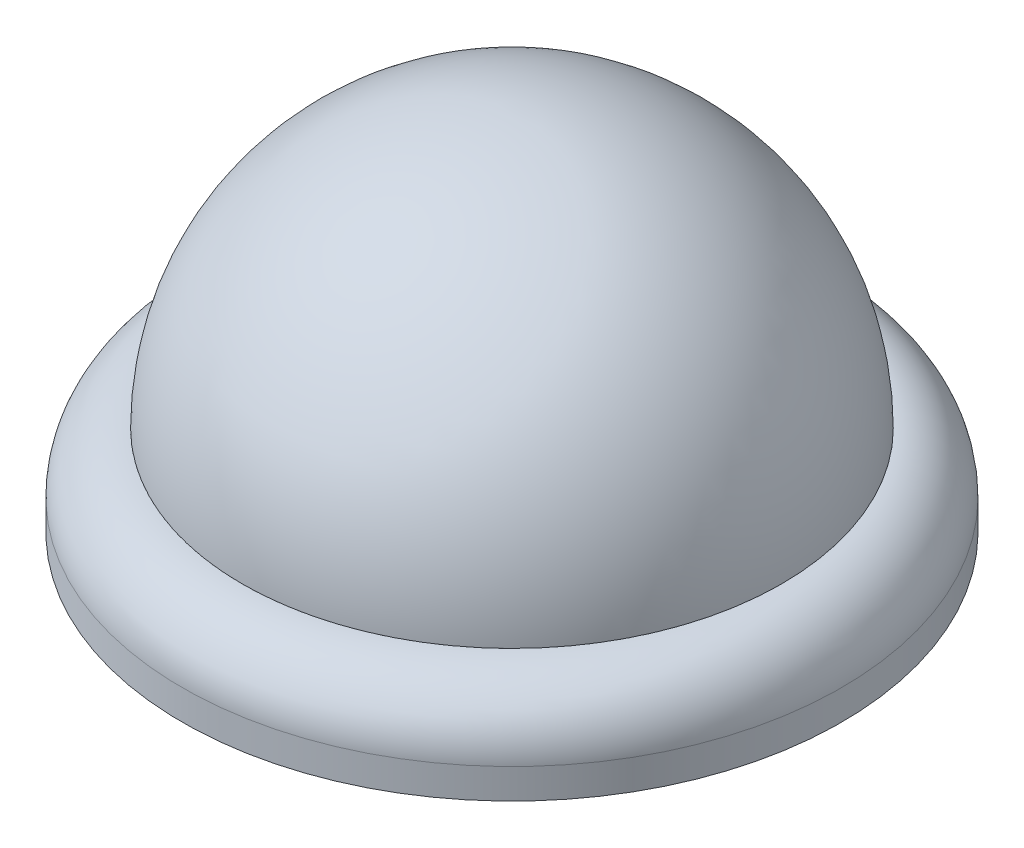
ISO-10303-21;
HEADER;
FILE_DESCRIPTION(('STEP AP214'),'2;1');
FILE_NAME('part.step','',(''),(''),'','','');
FILE_SCHEMA(('AUTOMOTIVE_DESIGN { 1 0 10303 214 1 1 1 1 }'));
ENDSEC;
DATA;
#1=APPLICATION_CONTEXT('core data for automotive mechanical design processes');
#2=APPLICATION_PROTOCOL_DEFINITION('international standard','automotive_design',2000,#1);
#3=PRODUCT_CONTEXT('',#1,'mechanical');
#4=PRODUCT('Part','Part','',(#3));
#5=PRODUCT_RELATED_PRODUCT_CATEGORY('part','',(#4));
#6=PRODUCT_DEFINITION_FORMATION('','',#4);
#7=PRODUCT_DEFINITION_CONTEXT('part definition',#1,'design');
#8=PRODUCT_DEFINITION('design','',#6,#7);
#9=PRODUCT_DEFINITION_SHAPE('','',#8);
#10=(LENGTH_UNIT() NAMED_UNIT(*) SI_UNIT(.MILLI.,.METRE.));
#11=(NAMED_UNIT(*) PLANE_ANGLE_UNIT() SI_UNIT($,.RADIAN.));
#12=(NAMED_UNIT(*) SI_UNIT($,.STERADIAN.) SOLID_ANGLE_UNIT());
#13=UNCERTAINTY_MEASURE_WITH_UNIT(LENGTH_MEASURE(1.E-05),#10,'distance_accuracy_value','');
#14=(GEOMETRIC_REPRESENTATION_CONTEXT(3) GLOBAL_UNCERTAINTY_ASSIGNED_CONTEXT((#13)) GLOBAL_UNIT_ASSIGNED_CONTEXT((#10,
#11,#12)) REPRESENTATION_CONTEXT('',''));
#15=CARTESIAN_POINT('',(0.,0.,0.));
#16=DIRECTION('',(0.,0.,1.));
#17=DIRECTION('',(1.,0.,0.));
#18=AXIS2_PLACEMENT_3D('',#15,#16,#17);
#19=CARTESIAN_POINT('',(0.,-12.5,0.));
#20=DIRECTION('',(0.,-1.,0.));
#21=DIRECTION('',(0.,0.,-1.));
#22=AXIS2_PLACEMENT_3D('',#19,#20,#21);
#23=CYLINDRICAL_SURFACE('',#22,50.);
#24=CARTESIAN_POINT('',(0.,-12.5,0.));
#25=DIRECTION('',(0.,-1.,0.));
#26=DIRECTION('',(0.,0.,-1.));
#27=AXIS2_PLACEMENT_3D('',#24,#25,#26);
#28=CIRCLE('',#27,50.);
#29=CARTESIAN_POINT('',(0.,-12.5,-50.));
#30=VERTEX_POINT('',#29);
#31=EDGE_CURVE('E11',#30,#30,#28,.T.);
#32=ORIENTED_EDGE('',*,*,#31,.T.);
#33=EDGE_LOOP('',(#32));
#34=FACE_BOUND('',#33,.T.);
#35=CARTESIAN_POINT('',(0.,-15.,0.));
#36=DIRECTION('',(0.,-1.,0.));
#37=DIRECTION('',(0.,0.,-1.));
#38=AXIS2_PLACEMENT_3D('',#35,#36,#37);
#39=CIRCLE('',#38,50.);
#40=CARTESIAN_POINT('',(0.,-15.,-50.));
#41=VERTEX_POINT('',#40);
#42=EDGE_CURVE('E45',#41,#41,#39,.T.);
#43=ORIENTED_EDGE('',*,*,#42,.F.);
#44=EDGE_LOOP('',(#43));
#45=FACE_BOUND('',#44,.T.);
#46=ADVANCED_FACE('F42',(#34,#45),#23,.T.);
#47=CARTESIAN_POINT('',(0.,-12.5,0.));
#48=DIRECTION('',(0.,-1.,0.));
#49=DIRECTION('',(0.,0.,-1.));
#50=AXIS2_PLACEMENT_3D('',#47,#48,#49);
#51=PLANE('',#50);
#52=ORIENTED_EDGE('',*,*,#31,.F.);
#53=EDGE_LOOP('',(#52));
#54=FACE_BOUND('',#53,.T.);
#55=ADVANCED_FACE('F57',(#54),#51,.F.);
#56=CARTESIAN_POINT('',(0.,-15.,0.));
#57=DIRECTION('',(0.,-1.,0.));
#58=DIRECTION('',(0.,0.,-1.));
#59=AXIS2_PLACEMENT_3D('',#56,#57,#58);
#60=PLANE('',#59);
#61=ORIENTED_EDGE('',*,*,#42,.T.);
#62=EDGE_LOOP('',(#61));
#63=FACE_BOUND('',#62,.T.);
#64=ADVANCED_FACE('F54',(#63),#60,.T.);
#65=CLOSED_SHELL('',(#46,#55,#64));
#66=MANIFOLD_SOLID_BREP('B2',#65);
#67=CARTESIAN_POINT('',(0.,0.,0.));
#68=DIRECTION('',(0.,-1.,0.));
#69=DIRECTION('',(0.,0.,-1.));
#70=AXIS2_PLACEMENT_3D('',#67,#68,#69);
#71=CYLINDRICAL_SURFACE('',#70,50.);
#72=CARTESIAN_POINT('',(0.,-5.,0.));
#73=DIRECTION('',(0.,-1.,0.));
#74=DIRECTION('',(0.,0.,-1.));
#75=AXIS2_PLACEMENT_3D('',#72,#73,#74);
#76=CIRCLE('',#75,50.);
#77=CARTESIAN_POINT('',(0.,-5.,-50.));
#78=VERTEX_POINT('',#77);
#79=EDGE_CURVE('E113',#78,#78,#76,.T.);
#80=ORIENTED_EDGE('',*,*,#79,.F.);
#81=EDGE_LOOP('',(#80));
#82=FACE_BOUND('',#81,.T.);
#83=CARTESIAN_POINT('',(0.,-15.,0.));
#84=DIRECTION('',(0.,-1.,0.));
#85=DIRECTION('',(0.,0.,-1.));
#86=AXIS2_PLACEMENT_3D('',#83,#84,#85);
#87=CIRCLE('',#86,50.);
#88=CARTESIAN_POINT('',(0.,-15.,-50.));
#89=VERTEX_POINT('',#88);
#90=EDGE_CURVE('E97',#89,#89,#87,.T.);
#91=ORIENTED_EDGE('',*,*,#90,.T.);
#92=EDGE_LOOP('',(#91));
#93=FACE_BOUND('',#92,.T.);
#94=ADVANCED_FACE('F90',(#82,#93),#71,.F.);
#95=CARTESIAN_POINT('',(-55.,-15.,0.));
#96=DIRECTION('',(0.,1.,0.));
#97=DIRECTION('',(0.,0.,1.));
#98=AXIS2_PLACEMENT_3D('',#95,#96,#97);
#99=PLANE('',#98);
#100=ORIENTED_EDGE('',*,*,#90,.F.);
#101=EDGE_LOOP('',(#100));
#102=FACE_BOUND('',#101,.T.);
#103=CARTESIAN_POINT('',(0.,-15.,0.));
#104=DIRECTION('',(0.,-1.,0.));
#105=DIRECTION('',(0.,0.,-1.));
#106=AXIS2_PLACEMENT_3D('',#103,#104,#105);
#107=CIRCLE('',#106,55.);
#108=CARTESIAN_POINT('',(0.,-15.,-55.));
#109=VERTEX_POINT('',#108);
#110=EDGE_CURVE('E101',#109,#109,#107,.T.);
#111=ORIENTED_EDGE('',*,*,#110,.T.);
#112=EDGE_LOOP('',(#111));
#113=FACE_BOUND('',#112,.T.);
#114=ADVANCED_FACE('F120',(#102,#113),#99,.F.);
#115=CARTESIAN_POINT('',(0.,0.,0.));
#116=DIRECTION('',(0.,-1.,0.));
#117=DIRECTION('',(0.,0.,-1.));
#118=AXIS2_PLACEMENT_3D('',#115,#116,#117);
#119=CYLINDRICAL_SURFACE('',#118,55.);
#120=CARTESIAN_POINT('',(0.,-10.,0.));
#121=DIRECTION('',(0.,-1.,0.));
#122=DIRECTION('',(0.,0.,-1.));
#123=AXIS2_PLACEMENT_3D('',#120,#121,#122);
#124=CIRCLE('',#123,55.);
#125=CARTESIAN_POINT('',(0.,-10.,-55.));
#126=VERTEX_POINT('',#125);
#127=EDGE_CURVE('E41',#126,#126,#124,.T.);
#128=ORIENTED_EDGE('',*,*,#127,.T.);
#129=EDGE_LOOP('',(#128));
#130=FACE_BOUND('',#129,.T.);
#131=ORIENTED_EDGE('',*,*,#110,.F.);
#132=EDGE_LOOP('',(#131));
#133=FACE_BOUND('',#132,.T.);
#134=ADVANCED_FACE('F124',(#130,#133),#119,.T.);
#135=CARTESIAN_POINT('',(0.,0.,0.));
#136=DIRECTION('',(0.,-1.,0.));
#137=DIRECTION('',(0.,0.,-1.));
#138=AXIS2_PLACEMENT_3D('',#135,#136,#137);
#139=CYLINDRICAL_SURFACE('',#138,45.);
#140=CARTESIAN_POINT('',(0.,0.,0.));
#141=DIRECTION('',(0.,-1.,0.));
#142=DIRECTION('',(0.,0.,-1.));
#143=AXIS2_PLACEMENT_3D('',#140,#141,#142);
#144=CIRCLE('',#143,45.);
#145=CARTESIAN_POINT('',(0.,0.,-45.));
#146=VERTEX_POINT('',#145);
#147=EDGE_CURVE('E105',#146,#146,#144,.T.);
#148=ORIENTED_EDGE('',*,*,#147,.F.);
#149=EDGE_LOOP('',(#148));
#150=FACE_BOUND('',#149,.T.);
#151=CARTESIAN_POINT('',(0.,-5.,0.));
#152=DIRECTION('',(0.,-1.,0.));
#153=DIRECTION('',(0.,0.,-1.));
#154=AXIS2_PLACEMENT_3D('',#151,#152,#153);
#155=CIRCLE('',#154,45.);
#156=CARTESIAN_POINT('',(0.,-5.,-45.));
#157=VERTEX_POINT('',#156);
#158=EDGE_CURVE('E110',#157,#157,#155,.T.);
#159=ORIENTED_EDGE('',*,*,#158,.T.);
#160=EDGE_LOOP('',(#159));
#161=FACE_BOUND('',#160,.T.);
#162=ADVANCED_FACE('F130',(#150,#161),#139,.F.);
#163=CARTESIAN_POINT('',(-50.,-5.,0.));
#164=DIRECTION('',(0.,1.,0.));
#165=DIRECTION('',(0.,0.,1.));
#166=AXIS2_PLACEMENT_3D('',#163,#164,#165);
#167=PLANE('',#166);
#168=ORIENTED_EDGE('',*,*,#158,.F.);
#169=EDGE_LOOP('',(#168));
#170=FACE_BOUND('',#169,.T.);
#171=ORIENTED_EDGE('',*,*,#79,.T.);
#172=EDGE_LOOP('',(#171));
#173=FACE_BOUND('',#172,.T.);
#174=ADVANCED_FACE('F117',(#170,#173),#167,.F.);
#175=CARTESIAN_POINT('',(0.,-10.,0.));
#176=DIRECTION('',(0.,-1.,0.));
#177=DIRECTION('',(0.,0.,-1.));
#178=AXIS2_PLACEMENT_3D('',#175,#176,#177);
#179=TOROIDAL_SURFACE('',#178,45.,10.);
#180=ORIENTED_EDGE('',*,*,#147,.T.);
#181=EDGE_LOOP('',(#180));
#182=FACE_BOUND('',#181,.T.);
#183=ORIENTED_EDGE('',*,*,#127,.F.);
#184=EDGE_LOOP('',(#183));
#185=FACE_BOUND('',#184,.T.);
#186=ADVANCED_FACE('F92',(#182,#185),#179,.T.);
#187=CLOSED_SHELL('',(#94,#114,#134,#162,#174,#186));
#188=MANIFOLD_SOLID_BREP('B6',#187);
#189=CARTESIAN_POINT('',(0.,-10.,0.));
#190=DIRECTION('',(0.,1.,0.));
#191=DIRECTION('',(0.,0.,1.));
#192=AXIS2_PLACEMENT_3D('',#189,#190,#191);
#193=SPHERICAL_SURFACE('',#192,10.);
#194=CARTESIAN_POINT('',(0.,-10.,0.));
#195=DIRECTION('',(0.,1.,0.));
#196=DIRECTION('',(0.,0.,1.));
#197=AXIS2_PLACEMENT_3D('',#194,#195,#196);
#198=CIRCLE('',#197,10.);
#199=CARTESIAN_POINT('',(0.,-10.,10.));
#200=VERTEX_POINT('',#199);
#201=EDGE_CURVE('E201',#200,#200,#198,.T.);
#202=ORIENTED_EDGE('',*,*,#201,.F.);
#203=EDGE_LOOP('',(#202));
#204=FACE_BOUND('',#203,.T.);
#205=ADVANCED_FACE('F182',(#204),#193,.F.);
#206=CARTESIAN_POINT('',(0.,0.,0.));
#207=DIRECTION('',(0.,1.,0.));
#208=DIRECTION('',(0.,0.,-1.));
#209=AXIS2_PLACEMENT_3D('',#206,#207,#208);
#210=SPHERICAL_SURFACE('',#209,45.);
#211=CARTESIAN_POINT('',(0.,0.,0.));
#212=DIRECTION('',(0.,1.,0.));
#213=DIRECTION('',(0.,0.,1.));
#214=AXIS2_PLACEMENT_3D('',#211,#212,#213);
#215=CIRCLE('',#214,45.);
#216=CARTESIAN_POINT('',(0.,0.,45.));
#217=VERTEX_POINT('',#216);
#218=EDGE_CURVE('E89',#217,#217,#215,.T.);
#219=ORIENTED_EDGE('',*,*,#218,.T.);
#220=EDGE_LOOP('',(#219));
#221=FACE_BOUND('',#220,.T.);
#222=ADVANCED_FACE('F267',(#221),#210,.T.);
#223=CARTESIAN_POINT('',(0.,45.,0.));
#224=DIRECTION('',(0.,1.,0.));
#225=DIRECTION('',(0.,0.,1.));
#226=AXIS2_PLACEMENT_3D('',#223,#224,#225);
#227=CYLINDRICAL_SURFACE('',#226,45.);
#228=CARTESIAN_POINT('',(0.,-5.,0.));
#229=DIRECTION('',(0.,1.,0.));
#230=DIRECTION('',(0.,0.,1.));
#231=AXIS2_PLACEMENT_3D('',#228,#229,#230);
#232=CIRCLE('',#231,45.);
#233=CARTESIAN_POINT('',(0.,-5.,45.));
#234=VERTEX_POINT('',#233);
#235=EDGE_CURVE('E188',#234,#234,#232,.T.);
#236=ORIENTED_EDGE('',*,*,#235,.T.);
#237=EDGE_LOOP('',(#236));
#238=FACE_BOUND('',#237,.T.);
#239=ORIENTED_EDGE('',*,*,#218,.F.);
#240=EDGE_LOOP('',(#239));
#241=FACE_BOUND('',#240,.T.);
#242=ADVANCED_FACE('F262',(#238,#241),#227,.T.);
#243=CARTESIAN_POINT('',(0.,-5.00000000000001,45.));
#244=DIRECTION('',(0.,1.,0.));
#245=DIRECTION('',(0.,0.,1.));
#246=AXIS2_PLACEMENT_3D('',#243,#244,#245);
#247=PLANE('',#246);
#248=CARTESIAN_POINT('',(0.,-5.,0.));
#249=DIRECTION('',(0.,1.,0.));
#250=DIRECTION('',(0.,0.,1.));
#251=AXIS2_PLACEMENT_3D('',#248,#249,#250);
#252=CIRCLE('',#251,50.);
#253=CARTESIAN_POINT('',(0.,-5.,50.));
#254=VERTEX_POINT('',#253);
#255=EDGE_CURVE('E192',#254,#254,#252,.T.);
#256=ORIENTED_EDGE('',*,*,#255,.T.);
#257=EDGE_LOOP('',(#256));
#258=FACE_BOUND('',#257,.T.);
#259=ORIENTED_EDGE('',*,*,#235,.F.);
#260=EDGE_LOOP('',(#259));
#261=FACE_BOUND('',#260,.T.);
#262=ADVANCED_FACE('F256',(#258,#261),#247,.T.);
#263=CARTESIAN_POINT('',(0.,45.,0.));
#264=DIRECTION('',(0.,1.,0.));
#265=DIRECTION('',(0.,0.,1.));
#266=AXIS2_PLACEMENT_3D('',#263,#264,#265);
#267=CYLINDRICAL_SURFACE('',#266,50.);
#268=CARTESIAN_POINT('',(0.,-10.,0.));
#269=DIRECTION('',(0.,1.,0.));
#270=DIRECTION('',(0.,0.,1.));
#271=AXIS2_PLACEMENT_3D('',#268,#269,#270);
#272=CIRCLE('',#271,50.);
#273=CARTESIAN_POINT('',(0.,-10.,50.));
#274=VERTEX_POINT('',#273);
#275=EDGE_CURVE('E196',#274,#274,#272,.T.);
#276=ORIENTED_EDGE('',*,*,#275,.T.);
#277=EDGE_LOOP('',(#276));
#278=FACE_BOUND('',#277,.T.);
#279=ORIENTED_EDGE('',*,*,#255,.F.);
#280=EDGE_LOOP('',(#279));
#281=FACE_BOUND('',#280,.T.);
#282=ADVANCED_FACE('F242',(#278,#281),#267,.T.);
#283=CARTESIAN_POINT('',(0.,-10.,50.));
#284=DIRECTION('',(0.,-1.,0.));
#285=DIRECTION('',(0.,0.,-1.));
#286=AXIS2_PLACEMENT_3D('',#283,#284,#285);
#287=PLANE('',#286);
#288=CARTESIAN_POINT('',(-30.,-10.,3.11784026897587E-13));
#289=DIRECTION('',(0.,-1.,0.));
#290=DIRECTION('',(1.,0.,0.));
#291=AXIS2_PLACEMENT_3D('',#288,#289,#290);
#292=CIRCLE('',#291,5.);
#293=CARTESIAN_POINT('',(-25.,-10.,2.5941180681494E-13));
#294=VERTEX_POINT('',#293);
#295=EDGE_CURVE('E223',#294,#294,#292,.T.);
#296=ORIENTED_EDGE('',*,*,#295,.F.);
#297=EDGE_LOOP('',(#296));
#298=FACE_BOUND('',#297,.T.);
#299=CARTESIAN_POINT('',(0.,-10.,-30.));
#300=DIRECTION('',(0.,-1.,0.));
#301=DIRECTION('',(0.,0.,1.));
#302=AXIS2_PLACEMENT_3D('',#299,#300,#301);
#303=CIRCLE('',#302,5.);
#304=CARTESIAN_POINT('',(0.,-10.,-25.));
#305=VERTEX_POINT('',#304);
#306=EDGE_CURVE('E217',#305,#305,#303,.T.);
#307=ORIENTED_EDGE('',*,*,#306,.F.);
#308=EDGE_LOOP('',(#307));
#309=FACE_BOUND('',#308,.T.);
#310=CARTESIAN_POINT('',(30.,-10.,-1.02295146566999E-13));
#311=DIRECTION('',(0.,-1.,0.));
#312=DIRECTION('',(-1.,0.,0.));
#313=AXIS2_PLACEMENT_3D('',#310,#311,#312);
#314=CIRCLE('',#313,5.);
#315=CARTESIAN_POINT('',(25.,-10.,0.));
#316=VERTEX_POINT('',#315);
#317=EDGE_CURVE('E211',#316,#316,#314,.T.);
#318=ORIENTED_EDGE('',*,*,#317,.F.);
#319=EDGE_LOOP('',(#318));
#320=FACE_BOUND('',#319,.T.);
#321=CARTESIAN_POINT('',(0.,-10.,30.));
#322=DIRECTION('',(0.,-1.,0.));
#323=DIRECTION('',(0.,0.,-1.));
#324=AXIS2_PLACEMENT_3D('',#321,#322,#323);
#325=CIRCLE('',#324,5.);
#326=CARTESIAN_POINT('',(0.,-10.,25.));
#327=VERTEX_POINT('',#326);
#328=EDGE_CURVE('E205',#327,#327,#325,.T.);
#329=ORIENTED_EDGE('',*,*,#328,.F.);
#330=EDGE_LOOP('',(#329));
#331=FACE_BOUND('',#330,.T.);
#332=ORIENTED_EDGE('',*,*,#201,.T.);
#333=EDGE_LOOP('',(#332));
#334=FACE_BOUND('',#333,.T.);
#335=ORIENTED_EDGE('',*,*,#275,.F.);
#336=EDGE_LOOP('',(#335));
#337=FACE_BOUND('',#336,.T.);
#338=ADVANCED_FACE('F238',(#298,#309,#320,#331,#334,#337),#287,.T.);
#339=CARTESIAN_POINT('',(0.,-12.5,30.));
#340=DIRECTION('',(0.,1.,0.));
#341=DIRECTION('',(0.,0.,1.));
#342=AXIS2_PLACEMENT_3D('',#339,#340,#341);
#343=CYLINDRICAL_SURFACE('',#342,5.);
#344=CARTESIAN_POINT('',(0.,-12.5,30.));
#345=DIRECTION('',(0.,-1.,0.));
#346=DIRECTION('',(0.,0.,-1.));
#347=AXIS2_PLACEMENT_3D('',#344,#345,#346);
#348=CIRCLE('',#347,5.);
#349=CARTESIAN_POINT('',(0.,-12.5,25.));
#350=VERTEX_POINT('',#349);
#351=EDGE_CURVE('E204',#350,#350,#348,.T.);
#352=ORIENTED_EDGE('',*,*,#351,.F.);
#353=EDGE_LOOP('',(#352));
#354=FACE_BOUND('',#353,.T.);
#355=ORIENTED_EDGE('',*,*,#328,.T.);
#356=EDGE_LOOP('',(#355));
#357=FACE_BOUND('',#356,.T.);
#358=ADVANCED_FACE('F241',(#354,#357),#343,.T.);
#359=CARTESIAN_POINT('',(0.,-12.5,30.));
#360=DIRECTION('',(0.,-1.,0.));
#361=DIRECTION('',(0.,0.,-1.));
#362=AXIS2_PLACEMENT_3D('',#359,#360,#361);
#363=PLANE('',#362);
#364=ORIENTED_EDGE('',*,*,#351,.T.);
#365=EDGE_LOOP('',(#364));
#366=FACE_BOUND('',#365,.T.);
#367=ADVANCED_FACE('F300',(#366),#363,.T.);
#368=CARTESIAN_POINT('',(30.,-12.5,-1.02295146566999E-13));
#369=DIRECTION('',(0.,1.,0.));
#370=DIRECTION('',(0.,0.,1.));
#371=AXIS2_PLACEMENT_3D('',#368,#369,#370);
#372=CYLINDRICAL_SURFACE('',#371,5.);
#373=CARTESIAN_POINT('',(30.,-12.5,-1.02295146566999E-13));
#374=DIRECTION('',(0.,-1.,0.));
#375=DIRECTION('',(-1.,0.,0.));
#376=AXIS2_PLACEMENT_3D('',#373,#374,#375);
#377=CIRCLE('',#376,5.);
#378=CARTESIAN_POINT('',(25.,-12.5,0.));
#379=VERTEX_POINT('',#378);
#380=EDGE_CURVE('E208',#379,#379,#377,.T.);
#381=ORIENTED_EDGE('',*,*,#380,.F.);
#382=EDGE_LOOP('',(#381));
#383=FACE_BOUND('',#382,.T.);
#384=ORIENTED_EDGE('',*,*,#317,.T.);
#385=EDGE_LOOP('',(#384));
#386=FACE_BOUND('',#385,.T.);
#387=ADVANCED_FACE('F310',(#383,#386),#372,.T.);
#388=CARTESIAN_POINT('',(30.,-12.5,-1.02295146566999E-13));
#389=DIRECTION('',(0.,-1.,0.));
#390=DIRECTION('',(-1.,0.,0.));
#391=AXIS2_PLACEMENT_3D('',#388,#389,#390);
#392=PLANE('',#391);
#393=ORIENTED_EDGE('',*,*,#380,.T.);
#394=EDGE_LOOP('',(#393));
#395=FACE_BOUND('',#394,.T.);
#396=ADVANCED_FACE('F325',(#395),#392,.T.);
#397=CARTESIAN_POINT('',(0.,-12.5,-30.));
#398=DIRECTION('',(0.,1.,0.));
#399=DIRECTION('',(0.,0.,1.));
#400=AXIS2_PLACEMENT_3D('',#397,#398,#399);
#401=CYLINDRICAL_SURFACE('',#400,5.);
#402=CARTESIAN_POINT('',(0.,-12.5,-30.));
#403=DIRECTION('',(0.,-1.,0.));
#404=DIRECTION('',(0.,0.,1.));
#405=AXIS2_PLACEMENT_3D('',#402,#403,#404);
#406=CIRCLE('',#405,5.);
#407=CARTESIAN_POINT('',(0.,-12.5,-25.));
#408=VERTEX_POINT('',#407);
#409=EDGE_CURVE('E214',#408,#408,#406,.T.);
#410=ORIENTED_EDGE('',*,*,#409,.F.);
#411=EDGE_LOOP('',(#410));
#412=FACE_BOUND('',#411,.T.);
#413=ORIENTED_EDGE('',*,*,#306,.T.);
#414=EDGE_LOOP('',(#413));
#415=FACE_BOUND('',#414,.T.);
#416=ADVANCED_FACE('F335',(#412,#415),#401,.T.);
#417=CARTESIAN_POINT('',(0.,-12.5,-30.));
#418=DIRECTION('',(0.,-1.,0.));
#419=DIRECTION('',(0.,0.,1.));
#420=AXIS2_PLACEMENT_3D('',#417,#418,#419);
#421=PLANE('',#420);
#422=ORIENTED_EDGE('',*,*,#409,.T.);
#423=EDGE_LOOP('',(#422));
#424=FACE_BOUND('',#423,.T.);
#425=ADVANCED_FACE('F234',(#424),#421,.T.);
#426=CARTESIAN_POINT('',(-30.,-12.5,3.11784026897587E-13));
#427=DIRECTION('',(0.,1.,0.));
#428=DIRECTION('',(0.,0.,1.));
#429=AXIS2_PLACEMENT_3D('',#426,#427,#428);
#430=CYLINDRICAL_SURFACE('',#429,5.);
#431=CARTESIAN_POINT('',(-30.,-12.5,3.11784026897587E-13));
#432=DIRECTION('',(0.,-1.,0.));
#433=DIRECTION('',(1.,0.,0.));
#434=AXIS2_PLACEMENT_3D('',#431,#432,#433);
#435=CIRCLE('',#434,5.);
#436=CARTESIAN_POINT('',(-25.,-12.5,2.5941180681494E-13));
#437=VERTEX_POINT('',#436);
#438=EDGE_CURVE('E220',#437,#437,#435,.T.);
#439=ORIENTED_EDGE('',*,*,#438,.F.);
#440=EDGE_LOOP('',(#439));
#441=FACE_BOUND('',#440,.T.);
#442=ORIENTED_EDGE('',*,*,#295,.T.);
#443=EDGE_LOOP('',(#442));
#444=FACE_BOUND('',#443,.T.);
#445=ADVANCED_FACE('F231',(#441,#444),#430,.T.);
#446=CARTESIAN_POINT('',(-30.,-12.5,3.11784026897587E-13));
#447=DIRECTION('',(0.,-1.,0.));
#448=DIRECTION('',(1.,0.,0.));
#449=AXIS2_PLACEMENT_3D('',#446,#447,#448);
#450=PLANE('',#449);
#451=ORIENTED_EDGE('',*,*,#438,.T.);
#452=EDGE_LOOP('',(#451));
#453=FACE_BOUND('',#452,.T.);
#454=ADVANCED_FACE('F229',(#453),#450,.T.);
#455=CLOSED_SHELL('',(#205,#222,#242,#262,#282,#338,#358,#367,#387,#396,#416,#425,#445,#454));
#456=MANIFOLD_SOLID_BREP('B36',#455);
#457=ADVANCED_BREP_SHAPE_REPRESENTATION('',(#18,#66,#188,#456),#14);
#458=SHAPE_DEFINITION_REPRESENTATION(#9,#457);
ENDSEC;
END-ISO-10303-21;
